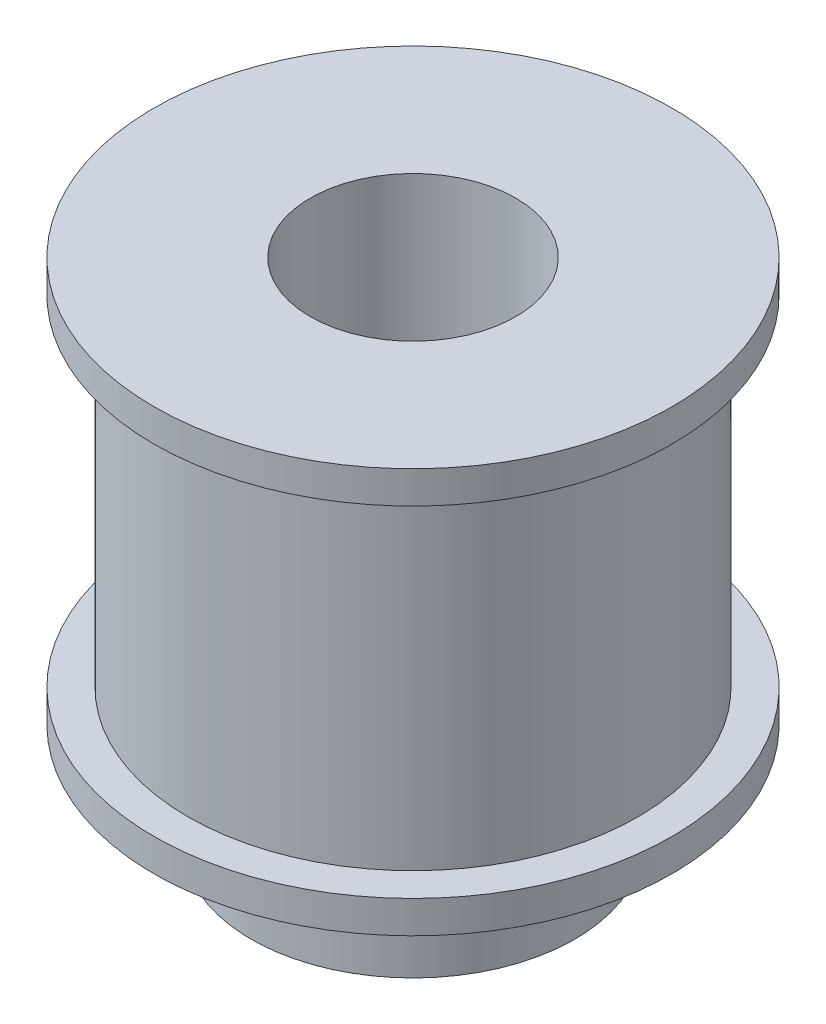
ISO-10303-21;
HEADER;
FILE_DESCRIPTION(('STEP AP214'),'2;1');
FILE_NAME('part.step','',(''),(''),'','','');
FILE_SCHEMA(('AUTOMOTIVE_DESIGN { 1 0 10303 214 1 1 1 1 }'));
ENDSEC;
DATA;
#1=APPLICATION_CONTEXT('core data for automotive mechanical design processes');
#2=APPLICATION_PROTOCOL_DEFINITION('international standard','automotive_design',2000,#1);
#3=PRODUCT_CONTEXT('',#1,'mechanical');
#4=PRODUCT('Part','Part','',(#3));
#5=PRODUCT_RELATED_PRODUCT_CATEGORY('part','',(#4));
#6=PRODUCT_DEFINITION_FORMATION('','',#4);
#7=PRODUCT_DEFINITION_CONTEXT('part definition',#1,'design');
#8=PRODUCT_DEFINITION('design','',#6,#7);
#9=PRODUCT_DEFINITION_SHAPE('','',#8);
#10=(LENGTH_UNIT() NAMED_UNIT(*) SI_UNIT(.MILLI.,.METRE.));
#11=(NAMED_UNIT(*) PLANE_ANGLE_UNIT() SI_UNIT($,.RADIAN.));
#12=(NAMED_UNIT(*) SI_UNIT($,.STERADIAN.) SOLID_ANGLE_UNIT());
#13=UNCERTAINTY_MEASURE_WITH_UNIT(LENGTH_MEASURE(1.E-05),#10,'distance_accuracy_value','');
#14=(GEOMETRIC_REPRESENTATION_CONTEXT(3) GLOBAL_UNCERTAINTY_ASSIGNED_CONTEXT((#13)) GLOBAL_UNIT_ASSIGNED_CONTEXT((#10,
#11,#12)) REPRESENTATION_CONTEXT('',''));
#15=CARTESIAN_POINT('',(0.,0.,0.));
#16=DIRECTION('',(0.,0.,1.));
#17=DIRECTION('',(1.,0.,0.));
#18=AXIS2_PLACEMENT_3D('',#15,#16,#17);
#19=CARTESIAN_POINT('',(0.,21.,0.));
#20=DIRECTION('',(0.,-1.,0.));
#21=DIRECTION('',(0.,0.,-1.));
#22=AXIS2_PLACEMENT_3D('',#19,#20,#21);
#23=CYLINDRICAL_SURFACE('',#22,13.9);
#24=CARTESIAN_POINT('',(0.,21.,0.));
#25=DIRECTION('',(0.,1.,0.));
#26=DIRECTION('',(0.,0.,1.));
#27=AXIS2_PLACEMENT_3D('',#24,#25,#26);
#28=CIRCLE('',#27,13.9);
#29=CARTESIAN_POINT('',(0.,21.,13.9));
#30=VERTEX_POINT('',#29);
#31=EDGE_CURVE('E10',#30,#30,#28,.T.);
#32=ORIENTED_EDGE('',*,*,#31,.F.);
#33=EDGE_LOOP('',(#32));
#34=FACE_BOUND('',#33,.T.);
#35=CARTESIAN_POINT('',(0.,0.,0.));
#36=DIRECTION('',(0.,1.,0.));
#37=DIRECTION('',(0.,0.,1.));
#38=AXIS2_PLACEMENT_3D('',#35,#36,#37);
#39=CIRCLE('',#38,13.9);
#40=CARTESIAN_POINT('',(0.,0.,13.9));
#41=VERTEX_POINT('',#40);
#42=EDGE_CURVE('E54',#41,#41,#39,.T.);
#43=ORIENTED_EDGE('',*,*,#42,.T.);
#44=EDGE_LOOP('',(#43));
#45=FACE_BOUND('',#44,.T.);
#46=ADVANCED_FACE('F37',(#34,#45),#23,.T.);
#47=CARTESIAN_POINT('',(0.,23.,0.));
#48=DIRECTION('',(0.,-1.,0.));
#49=DIRECTION('',(0.,0.,-1.));
#50=AXIS2_PLACEMENT_3D('',#47,#48,#49);
#51=CYLINDRICAL_SURFACE('',#50,16.);
#52=CARTESIAN_POINT('',(0.,23.,0.));
#53=DIRECTION('',(0.,1.,0.));
#54=DIRECTION('',(0.,0.,1.));
#55=AXIS2_PLACEMENT_3D('',#52,#53,#54);
#56=CIRCLE('',#55,16.);
#57=CARTESIAN_POINT('',(0.,23.,16.));
#58=VERTEX_POINT('',#57);
#59=EDGE_CURVE('E45',#58,#58,#56,.T.);
#60=ORIENTED_EDGE('',*,*,#59,.F.);
#61=EDGE_LOOP('',(#60));
#62=FACE_BOUND('',#61,.T.);
#63=CARTESIAN_POINT('',(0.,21.,0.));
#64=DIRECTION('',(0.,1.,0.));
#65=DIRECTION('',(0.,0.,1.));
#66=AXIS2_PLACEMENT_3D('',#63,#64,#65);
#67=CIRCLE('',#66,16.);
#68=CARTESIAN_POINT('',(0.,21.,16.));
#69=VERTEX_POINT('',#68);
#70=EDGE_CURVE('E51',#69,#69,#67,.T.);
#71=ORIENTED_EDGE('',*,*,#70,.T.);
#72=EDGE_LOOP('',(#71));
#73=FACE_BOUND('',#72,.T.);
#74=ADVANCED_FACE('F104',(#62,#73),#51,.T.);
#75=CARTESIAN_POINT('',(0.,23.,0.));
#76=DIRECTION('',(0.,1.,0.));
#77=DIRECTION('',(0.,0.,1.));
#78=AXIS2_PLACEMENT_3D('',#75,#76,#77);
#79=PLANE('',#78);
#80=CARTESIAN_POINT('',(0.,23.,0.));
#81=DIRECTION('',(0.,-1.,0.));
#82=DIRECTION('',(0.,0.,-1.));
#83=AXIS2_PLACEMENT_3D('',#80,#81,#82);
#84=CIRCLE('',#83,6.35);
#85=CARTESIAN_POINT('',(0.,23.,-6.35));
#86=VERTEX_POINT('',#85);
#87=EDGE_CURVE('E80',#86,#86,#84,.T.);
#88=ORIENTED_EDGE('',*,*,#87,.T.);
#89=EDGE_LOOP('',(#88));
#90=FACE_BOUND('',#89,.T.);
#91=ORIENTED_EDGE('',*,*,#59,.T.);
#92=EDGE_LOOP('',(#91));
#93=FACE_BOUND('',#92,.T.);
#94=ADVANCED_FACE('F109',(#90,#93),#79,.T.);
#95=CARTESIAN_POINT('',(0.,21.,0.));
#96=DIRECTION('',(0.,1.,0.));
#97=DIRECTION('',(0.,0.,1.));
#98=AXIS2_PLACEMENT_3D('',#95,#96,#97);
#99=PLANE('',#98);
#100=ORIENTED_EDGE('',*,*,#31,.T.);
#101=EDGE_LOOP('',(#100));
#102=FACE_BOUND('',#101,.T.);
#103=ORIENTED_EDGE('',*,*,#70,.F.);
#104=EDGE_LOOP('',(#103));
#105=FACE_BOUND('',#104,.T.);
#106=ADVANCED_FACE('F114',(#102,#105),#99,.F.);
#107=CARTESIAN_POINT('',(0.,-2.,0.));
#108=DIRECTION('',(0.,1.,0.));
#109=DIRECTION('',(0.,0.,1.));
#110=AXIS2_PLACEMENT_3D('',#107,#108,#109);
#111=CYLINDRICAL_SURFACE('',#110,16.);
#112=CARTESIAN_POINT('',(0.,-2.,0.));
#113=DIRECTION('',(0.,-1.,0.));
#114=DIRECTION('',(0.,0.,-1.));
#115=AXIS2_PLACEMENT_3D('',#112,#113,#114);
#116=CIRCLE('',#115,16.);
#117=CARTESIAN_POINT('',(0.,-2.,-16.));
#118=VERTEX_POINT('',#117);
#119=EDGE_CURVE('E57',#118,#118,#116,.T.);
#120=ORIENTED_EDGE('',*,*,#119,.F.);
#121=EDGE_LOOP('',(#120));
#122=FACE_BOUND('',#121,.T.);
#123=CARTESIAN_POINT('',(0.,0.,0.));
#124=DIRECTION('',(0.,-1.,0.));
#125=DIRECTION('',(0.,0.,-1.));
#126=AXIS2_PLACEMENT_3D('',#123,#124,#125);
#127=CIRCLE('',#126,16.);
#128=CARTESIAN_POINT('',(0.,0.,-16.));
#129=VERTEX_POINT('',#128);
#130=EDGE_CURVE('E64',#129,#129,#127,.T.);
#131=ORIENTED_EDGE('',*,*,#130,.T.);
#132=EDGE_LOOP('',(#131));
#133=FACE_BOUND('',#132,.T.);
#134=ADVANCED_FACE('F120',(#122,#133),#111,.T.);
#135=CARTESIAN_POINT('',(0.,-2.,0.));
#136=DIRECTION('',(0.,-1.,0.));
#137=DIRECTION('',(0.,0.,-1.));
#138=AXIS2_PLACEMENT_3D('',#135,#136,#137);
#139=PLANE('',#138);
#140=CARTESIAN_POINT('',(0.,-2.,0.));
#141=DIRECTION('',(0.,-1.,0.));
#142=DIRECTION('',(0.,0.,-1.));
#143=AXIS2_PLACEMENT_3D('',#140,#141,#142);
#144=CIRCLE('',#143,10.);
#145=CARTESIAN_POINT('',(0.,-2.,-10.));
#146=VERTEX_POINT('',#145);
#147=EDGE_CURVE('E73',#146,#146,#144,.T.);
#148=ORIENTED_EDGE('',*,*,#147,.F.);
#149=EDGE_LOOP('',(#148));
#150=FACE_BOUND('',#149,.T.);
#151=ORIENTED_EDGE('',*,*,#119,.T.);
#152=EDGE_LOOP('',(#151));
#153=FACE_BOUND('',#152,.T.);
#154=ADVANCED_FACE('F124',(#150,#153),#139,.T.);
#155=CARTESIAN_POINT('',(0.,0.,0.));
#156=DIRECTION('',(0.,-1.,0.));
#157=DIRECTION('',(0.,0.,-1.));
#158=AXIS2_PLACEMENT_3D('',#155,#156,#157);
#159=PLANE('',#158);
#160=ORIENTED_EDGE('',*,*,#42,.F.);
#161=EDGE_LOOP('',(#160));
#162=FACE_BOUND('',#161,.T.);
#163=ORIENTED_EDGE('',*,*,#130,.F.);
#164=EDGE_LOOP('',(#163));
#165=FACE_BOUND('',#164,.T.);
#166=ADVANCED_FACE('F126',(#162,#165),#159,.F.);
#167=CARTESIAN_POINT('',(0.,-8.5,0.));
#168=DIRECTION('',(0.,-1.,0.));
#169=DIRECTION('',(0.,0.,-1.));
#170=AXIS2_PLACEMENT_3D('',#167,#168,#169);
#171=PLANE('',#170);
#172=CARTESIAN_POINT('',(0.,-8.5,0.));
#173=DIRECTION('',(0.,-1.,0.));
#174=DIRECTION('',(0.,0.,-1.));
#175=AXIS2_PLACEMENT_3D('',#172,#173,#174);
#176=CIRCLE('',#175,6.35);
#177=CARTESIAN_POINT('',(0.,-8.5,-6.35));
#178=VERTEX_POINT('',#177);
#179=EDGE_CURVE('E40',#178,#178,#176,.F.);
#180=ORIENTED_EDGE('',*,*,#179,.T.);
#181=EDGE_LOOP('',(#180));
#182=FACE_BOUND('',#181,.T.);
#183=CARTESIAN_POINT('',(0.,-8.5,0.));
#184=DIRECTION('',(0.,-1.,0.));
#185=DIRECTION('',(0.,0.,-1.));
#186=AXIS2_PLACEMENT_3D('',#183,#184,#185);
#187=CIRCLE('',#186,10.);
#188=CARTESIAN_POINT('',(0.,-8.5,-10.));
#189=VERTEX_POINT('',#188);
#190=EDGE_CURVE('E70',#189,#189,#187,.T.);
#191=ORIENTED_EDGE('',*,*,#190,.T.);
#192=EDGE_LOOP('',(#191));
#193=FACE_BOUND('',#192,.T.);
#194=ADVANCED_FACE('F89',(#182,#193),#171,.T.);
#195=CARTESIAN_POINT('',(0.,-8.5,0.));
#196=DIRECTION('',(0.,1.,0.));
#197=DIRECTION('',(0.,0.,1.));
#198=AXIS2_PLACEMENT_3D('',#195,#196,#197);
#199=CYLINDRICAL_SURFACE('',#198,10.);
#200=ORIENTED_EDGE('',*,*,#190,.F.);
#201=EDGE_LOOP('',(#200));
#202=FACE_BOUND('',#201,.T.);
#203=ORIENTED_EDGE('',*,*,#147,.T.);
#204=EDGE_LOOP('',(#203));
#205=FACE_BOUND('',#204,.T.);
#206=ADVANCED_FACE('F95',(#202,#205),#199,.T.);
#207=CARTESIAN_POINT('',(0.,-12.,0.));
#208=DIRECTION('',(0.,1.,0.));
#209=DIRECTION('',(0.,0.,1.));
#210=AXIS2_PLACEMENT_3D('',#207,#208,#209);
#211=CYLINDRICAL_SURFACE('',#210,6.35);
#212=ORIENTED_EDGE('',*,*,#179,.F.);
#213=EDGE_LOOP('',(#212));
#214=FACE_BOUND('',#213,.T.);
#215=ORIENTED_EDGE('',*,*,#87,.F.);
#216=EDGE_LOOP('',(#215));
#217=FACE_BOUND('',#216,.T.);
#218=ADVANCED_FACE('F92',(#214,#217),#211,.F.);
#219=CLOSED_SHELL('',(#46,#74,#94,#106,#134,#154,#166,#194,#206,#218));
#220=MANIFOLD_SOLID_BREP('B2',#219);
#221=ADVANCED_BREP_SHAPE_REPRESENTATION('',(#18,#220),#14);
#222=SHAPE_DEFINITION_REPRESENTATION(#9,#221);
ENDSEC;
END-ISO-10303-21;
